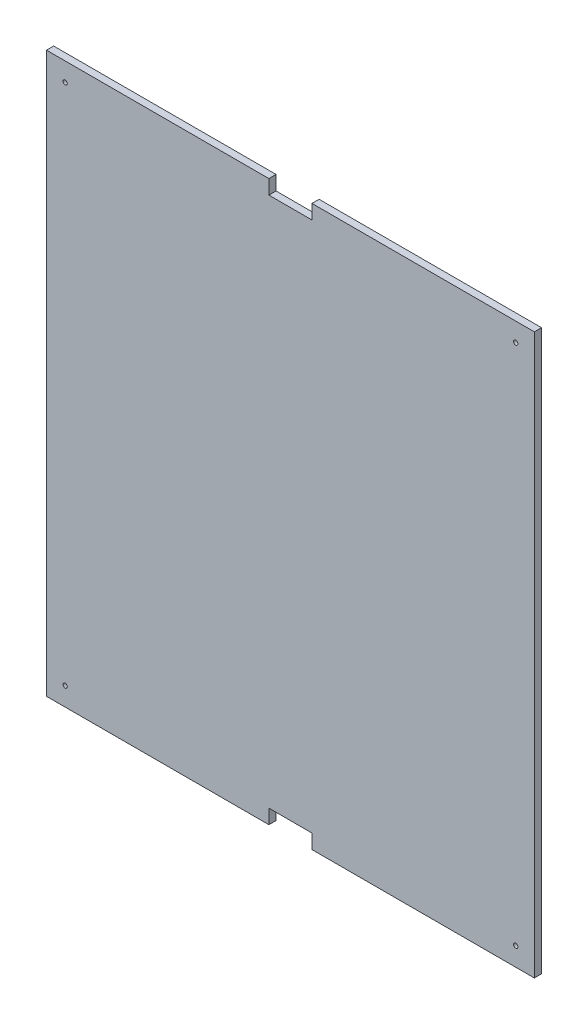
ISO-10303-21;
HEADER;
FILE_DESCRIPTION(('STEP AP214'),'2;1');
FILE_NAME('part.step','',(''),(''),'','','');
FILE_SCHEMA(('AUTOMOTIVE_DESIGN { 1 0 10303 214 1 1 1 1 }'));
ENDSEC;
DATA;
#1=APPLICATION_CONTEXT('core data for automotive mechanical design processes');
#2=APPLICATION_PROTOCOL_DEFINITION('international standard','automotive_design',2000,#1);
#3=PRODUCT_CONTEXT('',#1,'mechanical');
#4=PRODUCT('Part','Part','',(#3));
#5=PRODUCT_RELATED_PRODUCT_CATEGORY('part','',(#4));
#6=PRODUCT_DEFINITION_FORMATION('','',#4);
#7=PRODUCT_DEFINITION_CONTEXT('part definition',#1,'design');
#8=PRODUCT_DEFINITION('design','',#6,#7);
#9=PRODUCT_DEFINITION_SHAPE('','',#8);
#10=(LENGTH_UNIT() NAMED_UNIT(*) SI_UNIT(.MILLI.,.METRE.));
#11=(NAMED_UNIT(*) PLANE_ANGLE_UNIT() SI_UNIT($,.RADIAN.));
#12=(NAMED_UNIT(*) SI_UNIT($,.STERADIAN.) SOLID_ANGLE_UNIT());
#13=UNCERTAINTY_MEASURE_WITH_UNIT(LENGTH_MEASURE(1.E-05),#10,'distance_accuracy_value','');
#14=(GEOMETRIC_REPRESENTATION_CONTEXT(3) GLOBAL_UNCERTAINTY_ASSIGNED_CONTEXT((#13)) GLOBAL_UNIT_ASSIGNED_CONTEXT((#10,
#11,#12)) REPRESENTATION_CONTEXT('',''));
#15=CARTESIAN_POINT('',(0.,0.,0.));
#16=DIRECTION('',(0.,0.,1.));
#17=DIRECTION('',(1.,0.,0.));
#18=AXIS2_PLACEMENT_3D('',#15,#16,#17);
#19=CARTESIAN_POINT('',(0.,0.,5.));
#20=DIRECTION('',(0.,0.,-1.));
#21=DIRECTION('',(-1.,0.,0.));
#22=AXIS2_PLACEMENT_3D('',#19,#20,#21);
#23=PLANE('',#22);
#24=DIRECTION('',(-1.,0.,0.));
#25=VECTOR('',#24,1.);
#26=CARTESIAN_POINT('',(-108.397386715113,49.5360255420485,5.));
#27=LINE('',#26,#25);
#28=CARTESIAN_POINT('',(46.6026132848872,49.5360255420485,5.));
#29=VERTEX_POINT('',#28);
#30=CARTESIAN_POINT('',(-108.397386715113,49.5360255420485,5.));
#31=VERTEX_POINT('',#30);
#32=EDGE_CURVE('E177',#29,#31,#27,.T.);
#33=ORIENTED_EDGE('',*,*,#32,.T.);
#34=DIRECTION('',(0.,-1.,0.));
#35=VECTOR('',#34,1.);
#36=CARTESIAN_POINT('',(-108.397386715113,49.5360255420485,5.));
#37=LINE('',#36,#35);
#38=CARTESIAN_POINT('',(-108.397386715113,-340.463974457952,5.));
#39=VERTEX_POINT('',#38);
#40=EDGE_CURVE('E105',#31,#39,#37,.T.);
#41=ORIENTED_EDGE('',*,*,#40,.T.);
#42=DIRECTION('',(1.,0.,0.));
#43=VECTOR('',#42,1.);
#44=CARTESIAN_POINT('',(-108.397386715113,-340.463974457952,5.));
#45=LINE('',#44,#43);
#46=CARTESIAN_POINT('',(46.6026132848871,-340.463974457952,5.));
#47=VERTEX_POINT('',#46);
#48=EDGE_CURVE('E204',#39,#47,#45,.T.);
#49=ORIENTED_EDGE('',*,*,#48,.T.);
#50=DIRECTION('',(0.,1.,0.));
#51=VECTOR('',#50,1.);
#52=CARTESIAN_POINT('',(46.6026132848871,-340.463974457952,5.));
#53=LINE('',#52,#51);
#54=CARTESIAN_POINT('',(46.6026132848872,-330.463974457952,5.));
#55=VERTEX_POINT('',#54);
#56=EDGE_CURVE('E223',#47,#55,#53,.T.);
#57=ORIENTED_EDGE('',*,*,#56,.T.);
#58=DIRECTION('',(1.,0.,0.));
#59=VECTOR('',#58,1.);
#60=CARTESIAN_POINT('',(46.6026132848872,-330.463974457952,5.));
#61=LINE('',#60,#59);
#62=CARTESIAN_POINT('',(76.6026132848872,-330.463974457952,5.));
#63=VERTEX_POINT('',#62);
#64=EDGE_CURVE('E220',#55,#63,#61,.T.);
#65=ORIENTED_EDGE('',*,*,#64,.T.);
#66=DIRECTION('',(0.,-1.,0.));
#67=VECTOR('',#66,1.);
#68=CARTESIAN_POINT('',(76.6026132848872,-340.463974457952,5.));
#69=LINE('',#68,#67);
#70=CARTESIAN_POINT('',(76.6026132848872,-340.463974457952,5.));
#71=VERTEX_POINT('',#70);
#72=EDGE_CURVE('E222',#63,#71,#69,.T.);
#73=ORIENTED_EDGE('',*,*,#72,.T.);
#74=DIRECTION('',(1.,0.,0.));
#75=VECTOR('',#74,1.);
#76=CARTESIAN_POINT('',(76.6026132848872,-340.463974457952,5.));
#77=LINE('',#76,#75);
#78=CARTESIAN_POINT('',(231.602613284887,-340.463974457952,5.));
#79=VERTEX_POINT('',#78);
#80=EDGE_CURVE('E225',#71,#79,#77,.T.);
#81=ORIENTED_EDGE('',*,*,#80,.T.);
#82=DIRECTION('',(0.,1.,0.));
#83=VECTOR('',#82,1.);
#84=CARTESIAN_POINT('',(231.602613284887,49.5360255420485,5.));
#85=LINE('',#84,#83);
#86=CARTESIAN_POINT('',(231.602613284887,49.5360255420485,5.));
#87=VERTEX_POINT('',#86);
#88=EDGE_CURVE('E231',#79,#87,#85,.T.);
#89=ORIENTED_EDGE('',*,*,#88,.T.);
#90=DIRECTION('',(-1.,0.,0.));
#91=VECTOR('',#90,1.);
#92=CARTESIAN_POINT('',(231.602613284887,49.5360255420485,5.));
#93=LINE('',#92,#91);
#94=CARTESIAN_POINT('',(76.6026132848872,49.5360255420485,5.));
#95=VERTEX_POINT('',#94);
#96=EDGE_CURVE('E136',#87,#95,#93,.T.);
#97=ORIENTED_EDGE('',*,*,#96,.T.);
#98=DIRECTION('',(0.,-1.,0.));
#99=VECTOR('',#98,1.);
#100=CARTESIAN_POINT('',(76.6026132848872,49.5360255420485,5.));
#101=LINE('',#100,#99);
#102=CARTESIAN_POINT('',(76.6026132848872,39.5360255420485,5.));
#103=VERTEX_POINT('',#102);
#104=EDGE_CURVE('E130',#95,#103,#101,.T.);
#105=ORIENTED_EDGE('',*,*,#104,.T.);
#106=DIRECTION('',(-1.,0.,0.));
#107=VECTOR('',#106,1.);
#108=CARTESIAN_POINT('',(46.6026132848872,39.5360255420485,5.));
#109=LINE('',#108,#107);
#110=CARTESIAN_POINT('',(46.6026132848872,39.5360255420485,5.));
#111=VERTEX_POINT('',#110);
#112=EDGE_CURVE('E134',#103,#111,#109,.T.);
#113=ORIENTED_EDGE('',*,*,#112,.T.);
#114=DIRECTION('',(0.,1.,0.));
#115=VECTOR('',#114,1.);
#116=CARTESIAN_POINT('',(46.6026132848872,49.5360255420485,5.));
#117=LINE('',#116,#115);
#118=EDGE_CURVE('E50',#111,#29,#117,.T.);
#119=ORIENTED_EDGE('',*,*,#118,.T.);
#120=EDGE_LOOP('',(#33,#41,#49,#57,#65,#73,#81,#89,#97,#105,#113,#119));
#121=FACE_BOUND('',#120,.T.);
#122=CARTESIAN_POINT('',(-95.3973867151128,-327.463974457952,5.));
#123=DIRECTION('',(0.,0.,1.));
#124=DIRECTION('',(1.,0.,0.));
#125=AXIS2_PLACEMENT_3D('',#122,#123,#124);
#126=CIRCLE('',#125,1.5);
#127=CARTESIAN_POINT('',(-93.8973867151128,-327.463974457952,5.));
#128=VERTEX_POINT('',#127);
#129=EDGE_CURVE('E158',#128,#128,#126,.T.);
#130=ORIENTED_EDGE('',*,*,#129,.F.);
#131=EDGE_LOOP('',(#130));
#132=FACE_BOUND('',#131,.T.);
#133=CARTESIAN_POINT('',(218.602613284887,-327.463974457952,5.));
#134=DIRECTION('',(0.,0.,1.));
#135=DIRECTION('',(1.,0.,0.));
#136=AXIS2_PLACEMENT_3D('',#133,#134,#135);
#137=CIRCLE('',#136,1.50000000000002);
#138=CARTESIAN_POINT('',(220.102613284887,-327.463974457952,5.));
#139=VERTEX_POINT('',#138);
#140=EDGE_CURVE('E295',#139,#139,#137,.T.);
#141=ORIENTED_EDGE('',*,*,#140,.F.);
#142=EDGE_LOOP('',(#141));
#143=FACE_BOUND('',#142,.T.);
#144=CARTESIAN_POINT('',(218.602613284887,36.5360255420485,5.));
#145=DIRECTION('',(0.,0.,1.));
#146=DIRECTION('',(1.,0.,0.));
#147=AXIS2_PLACEMENT_3D('',#144,#145,#146);
#148=CIRCLE('',#147,1.50000000000003);
#149=CARTESIAN_POINT('',(220.102613284887,36.5360255420485,5.));
#150=VERTEX_POINT('',#149);
#151=EDGE_CURVE('E289',#150,#150,#148,.T.);
#152=ORIENTED_EDGE('',*,*,#151,.F.);
#153=EDGE_LOOP('',(#152));
#154=FACE_BOUND('',#153,.T.);
#155=CARTESIAN_POINT('',(-95.3973867151129,36.5360255420485,5.));
#156=DIRECTION('',(0.,0.,1.));
#157=DIRECTION('',(1.,0.,0.));
#158=AXIS2_PLACEMENT_3D('',#155,#156,#157);
#159=CIRCLE('',#158,1.5);
#160=CARTESIAN_POINT('',(-93.8973867151129,36.5360255420485,5.));
#161=VERTEX_POINT('',#160);
#162=EDGE_CURVE('E280',#161,#161,#159,.T.);
#163=ORIENTED_EDGE('',*,*,#162,.F.);
#164=EDGE_LOOP('',(#163));
#165=FACE_BOUND('',#164,.T.);
#166=ADVANCED_FACE('F33',(#121,#132,#143,#154,#165),#23,.F.);
#167=CARTESIAN_POINT('',(0.,0.,0.));
#168=DIRECTION('',(0.,0.,-1.));
#169=DIRECTION('',(-1.,0.,0.));
#170=AXIS2_PLACEMENT_3D('',#167,#168,#169);
#171=PLANE('',#170);
#172=CARTESIAN_POINT('',(218.602613284887,36.5360255420485,0.));
#173=DIRECTION('',(0.,0.,1.));
#174=DIRECTION('',(1.,0.,0.));
#175=AXIS2_PLACEMENT_3D('',#172,#173,#174);
#176=CIRCLE('',#175,1.50000000000003);
#177=CARTESIAN_POINT('',(220.102613284887,36.5360255420485,0.));
#178=VERTEX_POINT('',#177);
#179=EDGE_CURVE('E286',#178,#178,#176,.T.);
#180=ORIENTED_EDGE('',*,*,#179,.T.);
#181=EDGE_LOOP('',(#180));
#182=FACE_BOUND('',#181,.T.);
#183=CARTESIAN_POINT('',(-95.3973867151128,-327.463974457952,0.));
#184=DIRECTION('',(0.,0.,1.));
#185=DIRECTION('',(1.,0.,0.));
#186=AXIS2_PLACEMENT_3D('',#183,#184,#185);
#187=CIRCLE('',#186,1.5);
#188=CARTESIAN_POINT('',(-93.8973867151128,-327.463974457952,0.));
#189=VERTEX_POINT('',#188);
#190=EDGE_CURVE('E298',#189,#189,#187,.T.);
#191=ORIENTED_EDGE('',*,*,#190,.T.);
#192=EDGE_LOOP('',(#191));
#193=FACE_BOUND('',#192,.T.);
#194=DIRECTION('',(-1.,0.,0.));
#195=VECTOR('',#194,1.);
#196=CARTESIAN_POINT('',(-108.397386715113,49.5360255420485,0.));
#197=LINE('',#196,#195);
#198=CARTESIAN_POINT('',(46.6026132848872,49.5360255420485,0.));
#199=VERTEX_POINT('',#198);
#200=CARTESIAN_POINT('',(-108.397386715113,49.5360255420485,0.));
#201=VERTEX_POINT('',#200);
#202=EDGE_CURVE('E154',#199,#201,#197,.T.);
#203=ORIENTED_EDGE('',*,*,#202,.F.);
#204=DIRECTION('',(0.,1.,0.));
#205=VECTOR('',#204,1.);
#206=CARTESIAN_POINT('',(46.6026132848872,49.5360255420485,0.));
#207=LINE('',#206,#205);
#208=CARTESIAN_POINT('',(46.6026132848872,39.5360255420485,0.));
#209=VERTEX_POINT('',#208);
#210=EDGE_CURVE('E97',#209,#199,#207,.T.);
#211=ORIENTED_EDGE('',*,*,#210,.F.);
#212=DIRECTION('',(-1.,0.,0.));
#213=VECTOR('',#212,1.);
#214=CARTESIAN_POINT('',(46.6026132848872,39.5360255420485,0.));
#215=LINE('',#214,#213);
#216=CARTESIAN_POINT('',(76.6026132848872,39.5360255420485,0.));
#217=VERTEX_POINT('',#216);
#218=EDGE_CURVE('E91',#217,#209,#215,.T.);
#219=ORIENTED_EDGE('',*,*,#218,.F.);
#220=DIRECTION('',(0.,-1.,0.));
#221=VECTOR('',#220,1.);
#222=CARTESIAN_POINT('',(76.6026132848872,49.5360255420485,0.));
#223=LINE('',#222,#221);
#224=CARTESIAN_POINT('',(76.6026132848872,49.5360255420485,0.));
#225=VERTEX_POINT('',#224);
#226=EDGE_CURVE('E144',#225,#217,#223,.T.);
#227=ORIENTED_EDGE('',*,*,#226,.F.);
#228=DIRECTION('',(-1.,0.,0.));
#229=VECTOR('',#228,1.);
#230=CARTESIAN_POINT('',(231.602613284887,49.5360255420485,0.));
#231=LINE('',#230,#229);
#232=CARTESIAN_POINT('',(231.602613284887,49.5360255420485,0.));
#233=VERTEX_POINT('',#232);
#234=EDGE_CURVE('E172',#233,#225,#231,.T.);
#235=ORIENTED_EDGE('',*,*,#234,.F.);
#236=DIRECTION('',(0.,1.,0.));
#237=VECTOR('',#236,1.);
#238=CARTESIAN_POINT('',(231.602613284887,49.5360255420485,0.));
#239=LINE('',#238,#237);
#240=CARTESIAN_POINT('',(231.602613284887,-340.463974457952,0.));
#241=VERTEX_POINT('',#240);
#242=EDGE_CURVE('E170',#241,#233,#239,.T.);
#243=ORIENTED_EDGE('',*,*,#242,.F.);
#244=DIRECTION('',(1.,0.,0.));
#245=VECTOR('',#244,1.);
#246=CARTESIAN_POINT('',(76.6026132848872,-340.463974457952,0.));
#247=LINE('',#246,#245);
#248=CARTESIAN_POINT('',(76.6026132848872,-340.463974457952,0.));
#249=VERTEX_POINT('',#248);
#250=EDGE_CURVE('E168',#249,#241,#247,.T.);
#251=ORIENTED_EDGE('',*,*,#250,.F.);
#252=DIRECTION('',(0.,-1.,0.));
#253=VECTOR('',#252,1.);
#254=CARTESIAN_POINT('',(76.6026132848872,-340.463974457952,0.));
#255=LINE('',#254,#253);
#256=CARTESIAN_POINT('',(76.6026132848872,-330.463974457952,0.));
#257=VERTEX_POINT('',#256);
#258=EDGE_CURVE('E166',#257,#249,#255,.T.);
#259=ORIENTED_EDGE('',*,*,#258,.F.);
#260=DIRECTION('',(1.,0.,0.));
#261=VECTOR('',#260,1.);
#262=CARTESIAN_POINT('',(46.6026132848872,-330.463974457952,0.));
#263=LINE('',#262,#261);
#264=CARTESIAN_POINT('',(46.6026132848872,-330.463974457952,0.));
#265=VERTEX_POINT('',#264);
#266=EDGE_CURVE('E164',#265,#257,#263,.T.);
#267=ORIENTED_EDGE('',*,*,#266,.F.);
#268=DIRECTION('',(0.,1.,0.));
#269=VECTOR('',#268,1.);
#270=CARTESIAN_POINT('',(46.6026132848871,-340.463974457952,0.));
#271=LINE('',#270,#269);
#272=CARTESIAN_POINT('',(46.6026132848871,-340.463974457952,0.));
#273=VERTEX_POINT('',#272);
#274=EDGE_CURVE('E162',#273,#265,#271,.T.);
#275=ORIENTED_EDGE('',*,*,#274,.F.);
#276=DIRECTION('',(1.,0.,0.));
#277=VECTOR('',#276,1.);
#278=CARTESIAN_POINT('',(-108.397386715113,-340.463974457952,0.));
#279=LINE('',#278,#277);
#280=CARTESIAN_POINT('',(-108.397386715113,-340.463974457952,0.));
#281=VERTEX_POINT('',#280);
#282=EDGE_CURVE('E160',#281,#273,#279,.T.);
#283=ORIENTED_EDGE('',*,*,#282,.F.);
#284=DIRECTION('',(0.,-1.,0.));
#285=VECTOR('',#284,1.);
#286=CARTESIAN_POINT('',(-108.397386715113,49.5360255420485,0.));
#287=LINE('',#286,#285);
#288=EDGE_CURVE('E157',#201,#281,#287,.T.);
#289=ORIENTED_EDGE('',*,*,#288,.F.);
#290=EDGE_LOOP('',(#203,#211,#219,#227,#235,#243,#251,#259,#267,#275,#283,#289));
#291=FACE_BOUND('',#290,.T.);
#292=CARTESIAN_POINT('',(218.602613284887,-327.463974457952,0.));
#293=DIRECTION('',(0.,0.,1.));
#294=DIRECTION('',(1.,0.,0.));
#295=AXIS2_PLACEMENT_3D('',#292,#293,#294);
#296=CIRCLE('',#295,1.50000000000002);
#297=CARTESIAN_POINT('',(220.102613284887,-327.463974457952,0.));
#298=VERTEX_POINT('',#297);
#299=EDGE_CURVE('E292',#298,#298,#296,.T.);
#300=ORIENTED_EDGE('',*,*,#299,.T.);
#301=EDGE_LOOP('',(#300));
#302=FACE_BOUND('',#301,.T.);
#303=CARTESIAN_POINT('',(-95.3973867151129,36.5360255420485,0.));
#304=DIRECTION('',(0.,0.,1.));
#305=DIRECTION('',(1.,0.,0.));
#306=AXIS2_PLACEMENT_3D('',#303,#304,#305);
#307=CIRCLE('',#306,1.5);
#308=CARTESIAN_POINT('',(-93.8973867151129,36.5360255420485,0.));
#309=VERTEX_POINT('',#308);
#310=EDGE_CURVE('E283',#309,#309,#307,.T.);
#311=ORIENTED_EDGE('',*,*,#310,.T.);
#312=EDGE_LOOP('',(#311));
#313=FACE_BOUND('',#312,.T.);
#314=ADVANCED_FACE('F208',(#182,#193,#291,#302,#313),#171,.T.);
#315=CARTESIAN_POINT('',(-108.397386715113,49.5360255420485,5.));
#316=DIRECTION('',(0.,-1.,0.));
#317=DIRECTION('',(0.,0.,-1.));
#318=AXIS2_PLACEMENT_3D('',#315,#316,#317);
#319=PLANE('',#318);
#320=ORIENTED_EDGE('',*,*,#202,.T.);
#321=DIRECTION('',(0.,0.,-1.));
#322=VECTOR('',#321,1.);
#323=CARTESIAN_POINT('',(-108.397386715113,49.5360255420485,5.));
#324=LINE('',#323,#322);
#325=EDGE_CURVE('E11',#31,#201,#324,.T.);
#326=ORIENTED_EDGE('',*,*,#325,.F.);
#327=ORIENTED_EDGE('',*,*,#32,.F.);
#328=DIRECTION('',(0.,0.,-1.));
#329=VECTOR('',#328,1.);
#330=CARTESIAN_POINT('',(46.6026132848872,49.5360255420485,5.));
#331=LINE('',#330,#329);
#332=EDGE_CURVE('E150',#29,#199,#331,.T.);
#333=ORIENTED_EDGE('',*,*,#332,.T.);
#334=EDGE_LOOP('',(#320,#326,#327,#333));
#335=FACE_BOUND('',#334,.T.);
#336=ADVANCED_FACE('F35',(#335),#319,.F.);
#337=CARTESIAN_POINT('',(-108.397386715113,49.5360255420485,5.));
#338=DIRECTION('',(1.,0.,0.));
#339=DIRECTION('',(0.,1.,0.));
#340=AXIS2_PLACEMENT_3D('',#337,#338,#339);
#341=PLANE('',#340);
#342=ORIENTED_EDGE('',*,*,#288,.T.);
#343=DIRECTION('',(0.,0.,-1.));
#344=VECTOR('',#343,1.);
#345=CARTESIAN_POINT('',(-108.397386715113,-340.463974457952,5.));
#346=LINE('',#345,#344);
#347=EDGE_CURVE('E42',#39,#281,#346,.T.);
#348=ORIENTED_EDGE('',*,*,#347,.F.);
#349=ORIENTED_EDGE('',*,*,#40,.F.);
#350=ORIENTED_EDGE('',*,*,#325,.T.);
#351=EDGE_LOOP('',(#342,#348,#349,#350));
#352=FACE_BOUND('',#351,.T.);
#353=ADVANCED_FACE('F410',(#352),#341,.F.);
#354=CARTESIAN_POINT('',(-108.397386715113,-340.463974457952,5.));
#355=DIRECTION('',(0.,1.,0.));
#356=DIRECTION('',(0.,0.,1.));
#357=AXIS2_PLACEMENT_3D('',#354,#355,#356);
#358=PLANE('',#357);
#359=ORIENTED_EDGE('',*,*,#282,.T.);
#360=DIRECTION('',(0.,0.,-1.));
#361=VECTOR('',#360,1.);
#362=CARTESIAN_POINT('',(46.6026132848871,-340.463974457952,5.));
#363=LINE('',#362,#361);
#364=EDGE_CURVE('E196',#47,#273,#363,.T.);
#365=ORIENTED_EDGE('',*,*,#364,.F.);
#366=ORIENTED_EDGE('',*,*,#48,.F.);
#367=ORIENTED_EDGE('',*,*,#347,.T.);
#368=EDGE_LOOP('',(#359,#365,#366,#367));
#369=FACE_BOUND('',#368,.T.);
#370=ADVANCED_FACE('F202',(#369),#358,.F.);
#371=CARTESIAN_POINT('',(46.6026132848871,-340.463974457952,5.));
#372=DIRECTION('',(-1.,0.,0.));
#373=DIRECTION('',(0.,-1.,0.));
#374=AXIS2_PLACEMENT_3D('',#371,#372,#373);
#375=PLANE('',#374);
#376=ORIENTED_EDGE('',*,*,#274,.T.);
#377=DIRECTION('',(0.,0.,-1.));
#378=VECTOR('',#377,1.);
#379=CARTESIAN_POINT('',(46.6026132848872,-330.463974457952,5.));
#380=LINE('',#379,#378);
#381=EDGE_CURVE('E193',#55,#265,#380,.T.);
#382=ORIENTED_EDGE('',*,*,#381,.F.);
#383=ORIENTED_EDGE('',*,*,#56,.F.);
#384=ORIENTED_EDGE('',*,*,#364,.T.);
#385=EDGE_LOOP('',(#376,#382,#383,#384));
#386=FACE_BOUND('',#385,.T.);
#387=ADVANCED_FACE('F214',(#386),#375,.F.);
#388=CARTESIAN_POINT('',(46.6026132848872,-330.463974457952,5.));
#389=DIRECTION('',(0.,1.,0.));
#390=DIRECTION('',(0.,0.,1.));
#391=AXIS2_PLACEMENT_3D('',#388,#389,#390);
#392=PLANE('',#391);
#393=ORIENTED_EDGE('',*,*,#266,.T.);
#394=DIRECTION('',(0.,0.,-1.));
#395=VECTOR('',#394,1.);
#396=CARTESIAN_POINT('',(76.6026132848872,-330.463974457952,5.));
#397=LINE('',#396,#395);
#398=EDGE_CURVE('E190',#63,#257,#397,.T.);
#399=ORIENTED_EDGE('',*,*,#398,.F.);
#400=ORIENTED_EDGE('',*,*,#64,.F.);
#401=ORIENTED_EDGE('',*,*,#381,.T.);
#402=EDGE_LOOP('',(#393,#399,#400,#401));
#403=FACE_BOUND('',#402,.T.);
#404=ADVANCED_FACE('F218',(#403),#392,.F.);
#405=CARTESIAN_POINT('',(76.6026132848872,-340.463974457952,5.));
#406=DIRECTION('',(1.,0.,0.));
#407=DIRECTION('',(0.,0.,-1.));
#408=AXIS2_PLACEMENT_3D('',#405,#406,#407);
#409=PLANE('',#408);
#410=ORIENTED_EDGE('',*,*,#258,.T.);
#411=DIRECTION('',(0.,0.,-1.));
#412=VECTOR('',#411,1.);
#413=CARTESIAN_POINT('',(76.6026132848872,-340.463974457952,5.));
#414=LINE('',#413,#412);
#415=EDGE_CURVE('E187',#71,#249,#414,.T.);
#416=ORIENTED_EDGE('',*,*,#415,.F.);
#417=ORIENTED_EDGE('',*,*,#72,.F.);
#418=ORIENTED_EDGE('',*,*,#398,.T.);
#419=EDGE_LOOP('',(#410,#416,#417,#418));
#420=FACE_BOUND('',#419,.T.);
#421=ADVANCED_FACE('F375',(#420),#409,.F.);
#422=CARTESIAN_POINT('',(76.6026132848872,-340.463974457952,5.));
#423=DIRECTION('',(0.,1.,0.));
#424=DIRECTION('',(0.,0.,1.));
#425=AXIS2_PLACEMENT_3D('',#422,#423,#424);
#426=PLANE('',#425);
#427=ORIENTED_EDGE('',*,*,#250,.T.);
#428=DIRECTION('',(0.,0.,-1.));
#429=VECTOR('',#428,1.);
#430=CARTESIAN_POINT('',(231.602613284887,-340.463974457952,5.));
#431=LINE('',#430,#429);
#432=EDGE_CURVE('E184',#79,#241,#431,.T.);
#433=ORIENTED_EDGE('',*,*,#432,.F.);
#434=ORIENTED_EDGE('',*,*,#80,.F.);
#435=ORIENTED_EDGE('',*,*,#415,.T.);
#436=EDGE_LOOP('',(#427,#433,#434,#435));
#437=FACE_BOUND('',#436,.T.);
#438=ADVANCED_FACE('F366',(#437),#426,.F.);
#439=CARTESIAN_POINT('',(231.602613284887,49.5360255420485,5.));
#440=DIRECTION('',(-1.,0.,0.));
#441=DIRECTION('',(0.,-1.,0.));
#442=AXIS2_PLACEMENT_3D('',#439,#440,#441);
#443=PLANE('',#442);
#444=ORIENTED_EDGE('',*,*,#242,.T.);
#445=DIRECTION('',(0.,0.,-1.));
#446=VECTOR('',#445,1.);
#447=CARTESIAN_POINT('',(231.602613284887,49.5360255420485,5.));
#448=LINE('',#447,#446);
#449=EDGE_CURVE('E181',#87,#233,#448,.T.);
#450=ORIENTED_EDGE('',*,*,#449,.F.);
#451=ORIENTED_EDGE('',*,*,#88,.F.);
#452=ORIENTED_EDGE('',*,*,#432,.T.);
#453=EDGE_LOOP('',(#444,#450,#451,#452));
#454=FACE_BOUND('',#453,.T.);
#455=ADVANCED_FACE('F237',(#454),#443,.F.);
#456=CARTESIAN_POINT('',(231.602613284887,49.5360255420485,5.));
#457=DIRECTION('',(0.,-1.,0.));
#458=DIRECTION('',(1.,0.,0.));
#459=AXIS2_PLACEMENT_3D('',#456,#457,#458);
#460=PLANE('',#459);
#461=ORIENTED_EDGE('',*,*,#234,.T.);
#462=DIRECTION('',(0.,0.,-1.));
#463=VECTOR('',#462,1.);
#464=CARTESIAN_POINT('',(76.6026132848872,49.5360255420485,5.));
#465=LINE('',#464,#463);
#466=EDGE_CURVE('E145',#95,#225,#465,.T.);
#467=ORIENTED_EDGE('',*,*,#466,.F.);
#468=ORIENTED_EDGE('',*,*,#96,.F.);
#469=ORIENTED_EDGE('',*,*,#449,.T.);
#470=EDGE_LOOP('',(#461,#467,#468,#469));
#471=FACE_BOUND('',#470,.T.);
#472=ADVANCED_FACE('F241',(#471),#460,.F.);
#473=CARTESIAN_POINT('',(76.6026132848872,49.5360255420485,5.));
#474=DIRECTION('',(1.,0.,0.));
#475=DIRECTION('',(0.,0.,-1.));
#476=AXIS2_PLACEMENT_3D('',#473,#474,#475);
#477=PLANE('',#476);
#478=ORIENTED_EDGE('',*,*,#226,.T.);
#479=DIRECTION('',(0.,0.,-1.));
#480=VECTOR('',#479,1.);
#481=CARTESIAN_POINT('',(76.6026132848872,39.5360255420485,5.));
#482=LINE('',#481,#480);
#483=EDGE_CURVE('E141',#103,#217,#482,.T.);
#484=ORIENTED_EDGE('',*,*,#483,.F.);
#485=ORIENTED_EDGE('',*,*,#104,.F.);
#486=ORIENTED_EDGE('',*,*,#466,.T.);
#487=EDGE_LOOP('',(#478,#484,#485,#486));
#488=FACE_BOUND('',#487,.T.);
#489=ADVANCED_FACE('F142',(#488),#477,.F.);
#490=CARTESIAN_POINT('',(46.6026132848872,39.5360255420485,5.));
#491=DIRECTION('',(0.,-1.,0.));
#492=DIRECTION('',(1.,0.,0.));
#493=AXIS2_PLACEMENT_3D('',#490,#491,#492);
#494=PLANE('',#493);
#495=ORIENTED_EDGE('',*,*,#218,.T.);
#496=DIRECTION('',(0.,0.,-1.));
#497=VECTOR('',#496,1.);
#498=CARTESIAN_POINT('',(46.6026132848872,39.5360255420485,5.));
#499=LINE('',#498,#497);
#500=EDGE_CURVE('E146',#111,#209,#499,.T.);
#501=ORIENTED_EDGE('',*,*,#500,.F.);
#502=ORIENTED_EDGE('',*,*,#112,.F.);
#503=ORIENTED_EDGE('',*,*,#483,.T.);
#504=EDGE_LOOP('',(#495,#501,#502,#503));
#505=FACE_BOUND('',#504,.T.);
#506=ADVANCED_FACE('F148',(#505),#494,.F.);
#507=CARTESIAN_POINT('',(46.6026132848872,49.5360255420485,5.));
#508=DIRECTION('',(-1.,0.,0.));
#509=DIRECTION('',(0.,0.,1.));
#510=AXIS2_PLACEMENT_3D('',#507,#508,#509);
#511=PLANE('',#510);
#512=ORIENTED_EDGE('',*,*,#210,.T.);
#513=ORIENTED_EDGE('',*,*,#332,.F.);
#514=ORIENTED_EDGE('',*,*,#118,.F.);
#515=ORIENTED_EDGE('',*,*,#500,.T.);
#516=EDGE_LOOP('',(#512,#513,#514,#515));
#517=FACE_BOUND('',#516,.T.);
#518=ADVANCED_FACE('F245',(#517),#511,.F.);
#519=CARTESIAN_POINT('',(-95.3973867151128,-327.463974457952,5.));
#520=DIRECTION('',(0.,0.,-1.));
#521=DIRECTION('',(-1.,0.,0.));
#522=AXIS2_PLACEMENT_3D('',#519,#520,#521);
#523=CYLINDRICAL_SURFACE('',#522,1.5);
#524=ORIENTED_EDGE('',*,*,#129,.T.);
#525=EDGE_LOOP('',(#524));
#526=FACE_BOUND('',#525,.T.);
#527=ORIENTED_EDGE('',*,*,#190,.F.);
#528=EDGE_LOOP('',(#527));
#529=FACE_BOUND('',#528,.T.);
#530=ADVANCED_FACE('F247',(#526,#529),#523,.F.);
#531=CARTESIAN_POINT('',(218.602613284887,-327.463974457952,5.));
#532=DIRECTION('',(0.,0.,-1.));
#533=DIRECTION('',(-1.,0.,0.));
#534=AXIS2_PLACEMENT_3D('',#531,#532,#533);
#535=CYLINDRICAL_SURFACE('',#534,1.50000000000002);
#536=ORIENTED_EDGE('',*,*,#140,.T.);
#537=EDGE_LOOP('',(#536));
#538=FACE_BOUND('',#537,.T.);
#539=ORIENTED_EDGE('',*,*,#299,.F.);
#540=EDGE_LOOP('',(#539));
#541=FACE_BOUND('',#540,.T.);
#542=ADVANCED_FACE('F253',(#538,#541),#535,.F.);
#543=CARTESIAN_POINT('',(218.602613284887,36.5360255420485,5.));
#544=DIRECTION('',(0.,0.,-1.));
#545=DIRECTION('',(-1.,0.,0.));
#546=AXIS2_PLACEMENT_3D('',#543,#544,#545);
#547=CYLINDRICAL_SURFACE('',#546,1.50000000000003);
#548=ORIENTED_EDGE('',*,*,#151,.T.);
#549=EDGE_LOOP('',(#548));
#550=FACE_BOUND('',#549,.T.);
#551=ORIENTED_EDGE('',*,*,#179,.F.);
#552=EDGE_LOOP('',(#551));
#553=FACE_BOUND('',#552,.T.);
#554=ADVANCED_FACE('F267',(#550,#553),#547,.F.);
#555=CARTESIAN_POINT('',(-95.3973867151129,36.5360255420485,5.));
#556=DIRECTION('',(0.,0.,-1.));
#557=DIRECTION('',(-1.,0.,0.));
#558=AXIS2_PLACEMENT_3D('',#555,#556,#557);
#559=CYLINDRICAL_SURFACE('',#558,1.5);
#560=ORIENTED_EDGE('',*,*,#162,.T.);
#561=EDGE_LOOP('',(#560));
#562=FACE_BOUND('',#561,.T.);
#563=ORIENTED_EDGE('',*,*,#310,.F.);
#564=EDGE_LOOP('',(#563));
#565=FACE_BOUND('',#564,.T.);
#566=ADVANCED_FACE('F271',(#562,#565),#559,.F.);
#567=CLOSED_SHELL('',(#166,#314,#336,#353,#370,#387,#404,#421,#438,#455,#472,#489,#506,#518,
#530,#542,#554,#566));
#568=MANIFOLD_SOLID_BREP('B2',#567);
#569=ADVANCED_BREP_SHAPE_REPRESENTATION('',(#18,#568),#14);
#570=SHAPE_DEFINITION_REPRESENTATION(#9,#569);
ENDSEC;
END-ISO-10303-21;
